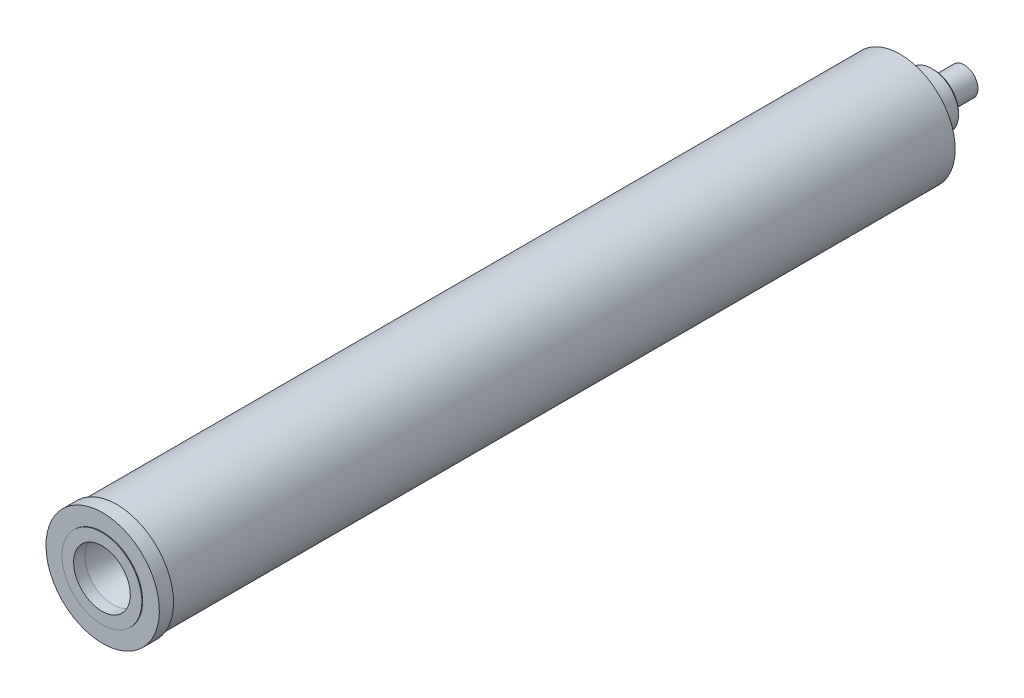
ISO-10303-21;
HEADER;
FILE_DESCRIPTION(('STEP AP214'),'2;1');
FILE_NAME('part.step','',(''),(''),'','','');
FILE_SCHEMA(('AUTOMOTIVE_DESIGN { 1 0 10303 214 1 1 1 1 }'));
ENDSEC;
DATA;
#1=APPLICATION_CONTEXT('core data for automotive mechanical design processes');
#2=APPLICATION_PROTOCOL_DEFINITION('international standard','automotive_design',2000,#1);
#3=PRODUCT_CONTEXT('',#1,'mechanical');
#4=PRODUCT('Part','Part','',(#3));
#5=PRODUCT_RELATED_PRODUCT_CATEGORY('part','',(#4));
#6=PRODUCT_DEFINITION_FORMATION('','',#4);
#7=PRODUCT_DEFINITION_CONTEXT('part definition',#1,'design');
#8=PRODUCT_DEFINITION('design','',#6,#7);
#9=PRODUCT_DEFINITION_SHAPE('','',#8);
#10=(LENGTH_UNIT() NAMED_UNIT(*) SI_UNIT(.MILLI.,.METRE.));
#11=(NAMED_UNIT(*) PLANE_ANGLE_UNIT() SI_UNIT($,.RADIAN.));
#12=(NAMED_UNIT(*) SI_UNIT($,.STERADIAN.) SOLID_ANGLE_UNIT());
#13=UNCERTAINTY_MEASURE_WITH_UNIT(LENGTH_MEASURE(1.E-05),#10,'distance_accuracy_value','');
#14=(GEOMETRIC_REPRESENTATION_CONTEXT(3) GLOBAL_UNCERTAINTY_ASSIGNED_CONTEXT((#13)) GLOBAL_UNIT_ASSIGNED_CONTEXT((#10,
#11,#12)) REPRESENTATION_CONTEXT('',''));
#15=CARTESIAN_POINT('',(0.,0.,0.));
#16=DIRECTION('',(0.,0.,1.));
#17=DIRECTION('',(1.,0.,0.));
#18=AXIS2_PLACEMENT_3D('',#15,#16,#17);
#19=CARTESIAN_POINT('',(0.,50.7999999999999,420.878));
#20=DIRECTION('',(0.,0.,1.));
#21=DIRECTION('',(0.,-1.,0.));
#22=AXIS2_PLACEMENT_3D('',#19,#20,#21);
#23=PLANE('',#22);
#24=CARTESIAN_POINT('',(0.,0.,420.878));
#25=DIRECTION('',(0.,0.,-1.));
#26=DIRECTION('',(0.,1.,0.));
#27=AXIS2_PLACEMENT_3D('',#24,#25,#26);
#28=CIRCLE('',#27,35.7999999999999);
#29=CARTESIAN_POINT('',(0.,35.7999999999999,420.878));
#30=VERTEX_POINT('',#29);
#31=EDGE_CURVE('E58',#30,#30,#28,.T.);
#32=ORIENTED_EDGE('',*,*,#31,.T.);
#33=EDGE_LOOP('',(#32));
#34=FACE_BOUND('',#33,.T.);
#35=CARTESIAN_POINT('',(0.,0.,420.878));
#36=DIRECTION('',(0.,0.,-1.));
#37=DIRECTION('',(0.,1.,0.));
#38=AXIS2_PLACEMENT_3D('',#35,#36,#37);
#39=CIRCLE('',#38,50.7999999999999);
#40=CARTESIAN_POINT('',(0.,50.7999999999999,420.878));
#41=VERTEX_POINT('',#40);
#42=EDGE_CURVE('E113',#41,#41,#39,.T.);
#43=ORIENTED_EDGE('',*,*,#42,.F.);
#44=EDGE_LOOP('',(#43));
#45=FACE_BOUND('',#44,.T.);
#46=ADVANCED_FACE('F39',(#34,#45),#23,.T.);
#47=CARTESIAN_POINT('',(0.,0.,-473.120013679823));
#48=DIRECTION('',(0.,0.,-1.));
#49=DIRECTION('',(0.,1.,0.));
#50=AXIS2_PLACEMENT_3D('',#47,#48,#49);
#51=CYLINDRICAL_SURFACE('',#50,50.7999999999999);
#52=ORIENTED_EDGE('',*,*,#42,.T.);
#53=EDGE_LOOP('',(#52));
#54=FACE_BOUND('',#53,.T.);
#55=CARTESIAN_POINT('',(0.,0.,408.178));
#56=DIRECTION('',(0.,0.,-1.));
#57=DIRECTION('',(0.,1.,0.));
#58=AXIS2_PLACEMENT_3D('',#55,#56,#57);
#59=CIRCLE('',#58,50.7999999999999);
#60=CARTESIAN_POINT('',(0.,50.7999999999999,408.178));
#61=VERTEX_POINT('',#60);
#62=EDGE_CURVE('E110',#61,#61,#59,.T.);
#63=ORIENTED_EDGE('',*,*,#62,.F.);
#64=EDGE_LOOP('',(#63));
#65=FACE_BOUND('',#64,.T.);
#66=ADVANCED_FACE('F132',(#54,#65),#51,.T.);
#67=CARTESIAN_POINT('',(0.,50.7999999999999,408.178));
#68=DIRECTION('',(0.,0.,-1.));
#69=DIRECTION('',(0.,1.,0.));
#70=AXIS2_PLACEMENT_3D('',#67,#68,#69);
#71=PLANE('',#70);
#72=ORIENTED_EDGE('',*,*,#62,.T.);
#73=EDGE_LOOP('',(#72));
#74=FACE_BOUND('',#73,.T.);
#75=CARTESIAN_POINT('',(0.,0.,408.178));
#76=DIRECTION('',(0.,0.,-1.));
#77=DIRECTION('',(0.,1.,0.));
#78=AXIS2_PLACEMENT_3D('',#75,#76,#77);
#79=CIRCLE('',#78,49.2124999999999);
#80=CARTESIAN_POINT('',(0.,49.2124999999999,408.178));
#81=VERTEX_POINT('',#80);
#82=EDGE_CURVE('E107',#81,#81,#79,.T.);
#83=ORIENTED_EDGE('',*,*,#82,.F.);
#84=EDGE_LOOP('',(#83));
#85=FACE_BOUND('',#84,.T.);
#86=ADVANCED_FACE('F137',(#74,#85),#71,.T.);
#87=CARTESIAN_POINT('',(0.,0.,-473.120013679823));
#88=DIRECTION('',(0.,0.,-1.));
#89=DIRECTION('',(0.,1.,0.));
#90=AXIS2_PLACEMENT_3D('',#87,#88,#89);
#91=CYLINDRICAL_SURFACE('',#90,49.2124999999999);
#92=ORIENTED_EDGE('',*,*,#82,.T.);
#93=EDGE_LOOP('',(#92));
#94=FACE_BOUND('',#93,.T.);
#95=CARTESIAN_POINT('',(0.,0.,-293.878));
#96=DIRECTION('',(0.,0.,-1.));
#97=DIRECTION('',(0.,1.,0.));
#98=AXIS2_PLACEMENT_3D('',#95,#96,#97);
#99=CIRCLE('',#98,49.2124999999999);
#100=CARTESIAN_POINT('',(0.,49.2124999999999,-293.878));
#101=VERTEX_POINT('',#100);
#102=EDGE_CURVE('E104',#101,#101,#99,.T.);
#103=ORIENTED_EDGE('',*,*,#102,.F.);
#104=EDGE_LOOP('',(#103));
#105=FACE_BOUND('',#104,.T.);
#106=ADVANCED_FACE('F144',(#94,#105),#91,.T.);
#107=CARTESIAN_POINT('',(0.,49.2124999999999,-293.878));
#108=DIRECTION('',(0.,0.,-1.));
#109=DIRECTION('',(0.,1.,0.));
#110=AXIS2_PLACEMENT_3D('',#107,#108,#109);
#111=PLANE('',#110);
#112=ORIENTED_EDGE('',*,*,#102,.T.);
#113=EDGE_LOOP('',(#112));
#114=FACE_BOUND('',#113,.T.);
#115=CARTESIAN_POINT('',(0.,0.,-293.878));
#116=DIRECTION('',(0.,0.,-1.));
#117=DIRECTION('',(0.,1.,0.));
#118=AXIS2_PLACEMENT_3D('',#115,#116,#117);
#119=CIRCLE('',#118,23.8759999999999);
#120=CARTESIAN_POINT('',(0.,23.876,-293.878));
#121=VERTEX_POINT('',#120);
#122=EDGE_CURVE('E101',#121,#121,#119,.T.);
#123=ORIENTED_EDGE('',*,*,#122,.F.);
#124=EDGE_LOOP('',(#123));
#125=FACE_BOUND('',#124,.T.);
#126=ADVANCED_FACE('F148',(#114,#125),#111,.T.);
#127=CARTESIAN_POINT('',(0.,0.,-473.120013679823));
#128=DIRECTION('',(0.,0.,-1.));
#129=DIRECTION('',(0.,1.,0.));
#130=AXIS2_PLACEMENT_3D('',#127,#128,#129);
#131=CYLINDRICAL_SURFACE('',#130,23.8759999999999);
#132=CARTESIAN_POINT('',(0.,0.,-322.223));
#133=DIRECTION('',(0.,0.,-1.));
#134=DIRECTION('',(0.,1.,0.));
#135=AXIS2_PLACEMENT_3D('',#132,#133,#134);
#136=CIRCLE('',#135,23.8759999999999);
#137=CARTESIAN_POINT('',(0.,23.876,-322.223));
#138=VERTEX_POINT('',#137);
#139=EDGE_CURVE('E11',#138,#138,#136,.F.);
#140=ORIENTED_EDGE('',*,*,#139,.T.);
#141=EDGE_LOOP('',(#140));
#142=FACE_BOUND('',#141,.T.);
#143=ORIENTED_EDGE('',*,*,#122,.T.);
#144=EDGE_LOOP('',(#143));
#145=FACE_BOUND('',#144,.T.);
#146=ADVANCED_FACE('F152',(#142,#145),#131,.T.);
#147=CARTESIAN_POINT('',(0.,23.876,-323.723));
#148=DIRECTION('',(0.,0.,-1.));
#149=DIRECTION('',(0.,1.,0.));
#150=AXIS2_PLACEMENT_3D('',#147,#148,#149);
#151=PLANE('',#150);
#152=CARTESIAN_POINT('',(0.,0.,-323.723));
#153=DIRECTION('',(0.,0.,-1.));
#154=DIRECTION('',(0.,1.,0.));
#155=AXIS2_PLACEMENT_3D('',#152,#153,#154);
#156=CIRCLE('',#155,22.3759999999998);
#157=CARTESIAN_POINT('',(0.,22.3759999999999,-323.723));
#158=VERTEX_POINT('',#157);
#159=EDGE_CURVE('E46',#158,#158,#156,.T.);
#160=ORIENTED_EDGE('',*,*,#159,.T.);
#161=EDGE_LOOP('',(#160));
#162=FACE_BOUND('',#161,.T.);
#163=CARTESIAN_POINT('',(0.,0.,-323.723));
#164=DIRECTION('',(0.,0.,-1.));
#165=DIRECTION('',(0.,1.,0.));
#166=AXIS2_PLACEMENT_3D('',#163,#164,#165);
#167=CIRCLE('',#166,12.4999999999999);
#168=CARTESIAN_POINT('',(0.,12.5,-323.723));
#169=VERTEX_POINT('',#168);
#170=EDGE_CURVE('E98',#169,#169,#167,.T.);
#171=ORIENTED_EDGE('',*,*,#170,.F.);
#172=EDGE_LOOP('',(#171));
#173=FACE_BOUND('',#172,.T.);
#174=ADVANCED_FACE('F118',(#162,#173),#151,.T.);
#175=CARTESIAN_POINT('',(0.,0.,-473.120013679823));
#176=DIRECTION('',(0.,0.,-1.));
#177=DIRECTION('',(0.,1.,0.));
#178=AXIS2_PLACEMENT_3D('',#175,#176,#177);
#179=CYLINDRICAL_SURFACE('',#178,12.4999999999999);
#180=ORIENTED_EDGE('',*,*,#170,.T.);
#181=EDGE_LOOP('',(#180));
#182=FACE_BOUND('',#181,.T.);
#183=CARTESIAN_POINT('',(0.,0.,-351.028));
#184=DIRECTION('',(0.,0.,-1.));
#185=DIRECTION('',(0.,1.,0.));
#186=AXIS2_PLACEMENT_3D('',#183,#184,#185);
#187=CIRCLE('',#186,12.4999999999999);
#188=CARTESIAN_POINT('',(0.,12.5,-351.028));
#189=VERTEX_POINT('',#188);
#190=EDGE_CURVE('E95',#189,#189,#187,.T.);
#191=ORIENTED_EDGE('',*,*,#190,.F.);
#192=EDGE_LOOP('',(#191));
#193=FACE_BOUND('',#192,.T.);
#194=ADVANCED_FACE('F159',(#182,#193),#179,.T.);
#195=CARTESIAN_POINT('',(0.,12.5,-351.028));
#196=DIRECTION('',(0.,0.,-1.));
#197=DIRECTION('',(0.,1.,0.));
#198=AXIS2_PLACEMENT_3D('',#195,#196,#197);
#199=PLANE('',#198);
#200=CARTESIAN_POINT('',(0.,0.,-351.028));
#201=DIRECTION('',(0.,0.,-1.));
#202=DIRECTION('',(0.,1.,0.));
#203=AXIS2_PLACEMENT_3D('',#200,#201,#202);
#204=CIRCLE('',#203,5.3975);
#205=CARTESIAN_POINT('',(0.,5.39750000000005,-351.028));
#206=VERTEX_POINT('',#205);
#207=EDGE_CURVE('E65',#206,#206,#204,.T.);
#208=ORIENTED_EDGE('',*,*,#207,.F.);
#209=EDGE_LOOP('',(#208));
#210=FACE_BOUND('',#209,.T.);
#211=ORIENTED_EDGE('',*,*,#190,.T.);
#212=EDGE_LOOP('',(#211));
#213=FACE_BOUND('',#212,.T.);
#214=ADVANCED_FACE('F162',(#210,#213),#199,.T.);
#215=CARTESIAN_POINT('',(0.,0.,-271.028));
#216=DIRECTION('',(0.,0.,1.));
#217=DIRECTION('',(0.,-1.,0.));
#218=AXIS2_PLACEMENT_3D('',#215,#216,#217);
#219=PLANE('',#218);
#220=CARTESIAN_POINT('',(0.,0.,-271.028));
#221=DIRECTION('',(0.,0.,-1.));
#222=DIRECTION('',(0.,1.,0.));
#223=AXIS2_PLACEMENT_3D('',#220,#221,#222);
#224=CIRCLE('',#223,29.2499999999999);
#225=CARTESIAN_POINT('',(0.,29.25,-271.028));
#226=VERTEX_POINT('',#225);
#227=EDGE_CURVE('E92',#226,#226,#224,.T.);
#228=ORIENTED_EDGE('',*,*,#227,.F.);
#229=EDGE_LOOP('',(#228));
#230=FACE_BOUND('',#229,.T.);
#231=ADVANCED_FACE('F166',(#230),#219,.T.);
#232=CARTESIAN_POINT('',(0.,0.,-473.120013679823));
#233=DIRECTION('',(0.,0.,-1.));
#234=DIRECTION('',(0.,1.,0.));
#235=AXIS2_PLACEMENT_3D('',#232,#233,#234);
#236=CYLINDRICAL_SURFACE('',#235,29.2499999999999);
#237=ORIENTED_EDGE('',*,*,#227,.T.);
#238=EDGE_LOOP('',(#237));
#239=FACE_BOUND('',#238,.T.);
#240=CARTESIAN_POINT('',(0.,0.,301.513));
#241=DIRECTION('',(0.,0.,-1.));
#242=DIRECTION('',(0.,1.,0.));
#243=AXIS2_PLACEMENT_3D('',#240,#241,#242);
#244=CIRCLE('',#243,29.2499999999999);
#245=CARTESIAN_POINT('',(0.,29.2499999999999,301.513));
#246=VERTEX_POINT('',#245);
#247=EDGE_CURVE('E89',#246,#246,#244,.T.);
#248=ORIENTED_EDGE('',*,*,#247,.F.);
#249=EDGE_LOOP('',(#248));
#250=FACE_BOUND('',#249,.T.);
#251=ADVANCED_FACE('F170',(#239,#250),#236,.F.);
#252=CARTESIAN_POINT('',(0.,29.2499999999999,301.513));
#253=DIRECTION('',(0.,0.,1.));
#254=DIRECTION('',(0.,-1.,0.));
#255=AXIS2_PLACEMENT_3D('',#252,#253,#254);
#256=PLANE('',#255);
#257=ORIENTED_EDGE('',*,*,#247,.T.);
#258=EDGE_LOOP('',(#257));
#259=FACE_BOUND('',#258,.T.);
#260=CARTESIAN_POINT('',(0.,0.,301.513));
#261=DIRECTION('',(0.,0.,-1.));
#262=DIRECTION('',(0.,1.,0.));
#263=AXIS2_PLACEMENT_3D('',#260,#261,#262);
#264=CIRCLE('',#263,40.2499999999999);
#265=CARTESIAN_POINT('',(0.,40.2499999999999,301.513));
#266=VERTEX_POINT('',#265);
#267=EDGE_CURVE('E86',#266,#266,#264,.T.);
#268=ORIENTED_EDGE('',*,*,#267,.F.);
#269=EDGE_LOOP('',(#268));
#270=FACE_BOUND('',#269,.T.);
#271=ADVANCED_FACE('F174',(#259,#270),#256,.T.);
#272=CARTESIAN_POINT('',(0.,0.,-473.120013679823));
#273=DIRECTION('',(0.,0.,-1.));
#274=DIRECTION('',(0.,1.,0.));
#275=AXIS2_PLACEMENT_3D('',#272,#273,#274);
#276=CYLINDRICAL_SURFACE('',#275,40.2499999999999);
#277=ORIENTED_EDGE('',*,*,#267,.T.);
#278=EDGE_LOOP('',(#277));
#279=FACE_BOUND('',#278,.T.);
#280=CARTESIAN_POINT('',(0.,0.,309.506817628507));
#281=DIRECTION('',(0.,0.,-1.));
#282=DIRECTION('',(0.,1.,0.));
#283=AXIS2_PLACEMENT_3D('',#280,#281,#282);
#284=CIRCLE('',#283,40.2499999999999);
#285=CARTESIAN_POINT('',(0.,40.2499999999999,309.506817628507));
#286=VERTEX_POINT('',#285);
#287=EDGE_CURVE('E83',#286,#286,#284,.T.);
#288=ORIENTED_EDGE('',*,*,#287,.F.);
#289=EDGE_LOOP('',(#288));
#290=FACE_BOUND('',#289,.T.);
#291=ADVANCED_FACE('F178',(#279,#290),#276,.F.);
#292=CARTESIAN_POINT('',(0.,0.,336.513));
#293=DIRECTION('',(0.,0.,-1.));
#294=DIRECTION('',(0.,1.,0.));
#295=AXIS2_PLACEMENT_3D('',#292,#293,#294);
#296=CONICAL_SURFACE('',#295,13.2438176285069,0.785398163397448);
#297=ORIENTED_EDGE('',*,*,#287,.T.);
#298=EDGE_LOOP('',(#297));
#299=FACE_BOUND('',#298,.T.);
#300=CARTESIAN_POINT('',(0.,0.,336.513));
#301=DIRECTION('',(0.,0.,-1.));
#302=DIRECTION('',(0.,1.,0.));
#303=AXIS2_PLACEMENT_3D('',#300,#301,#302);
#304=CIRCLE('',#303,13.2438176285069);
#305=CARTESIAN_POINT('',(0.,13.2438176285069,336.513));
#306=VERTEX_POINT('',#305);
#307=EDGE_CURVE('E80',#306,#306,#304,.T.);
#308=ORIENTED_EDGE('',*,*,#307,.F.);
#309=EDGE_LOOP('',(#308));
#310=FACE_BOUND('',#309,.T.);
#311=ADVANCED_FACE('F182',(#299,#310),#296,.F.);
#312=CARTESIAN_POINT('',(0.,0.,351.513));
#313=DIRECTION('',(0.,0.,1.));
#314=DIRECTION('',(0.,-1.,0.));
#315=AXIS2_PLACEMENT_3D('',#312,#313,#314);
#316=CONICAL_SURFACE('',#315,14.820381157492,0.104719755119653);
#317=ORIENTED_EDGE('',*,*,#307,.T.);
#318=EDGE_LOOP('',(#317));
#319=FACE_BOUND('',#318,.T.);
#320=CARTESIAN_POINT('',(0.,0.,351.513));
#321=DIRECTION('',(0.,0.,-1.));
#322=DIRECTION('',(0.,1.,0.));
#323=AXIS2_PLACEMENT_3D('',#320,#321,#322);
#324=CIRCLE('',#323,14.820381157492);
#325=CARTESIAN_POINT('',(0.,14.820381157492,351.513));
#326=VERTEX_POINT('',#325);
#327=EDGE_CURVE('E77',#326,#326,#324,.T.);
#328=ORIENTED_EDGE('',*,*,#327,.F.);
#329=EDGE_LOOP('',(#328));
#330=FACE_BOUND('',#329,.T.);
#331=ADVANCED_FACE('F186',(#319,#330),#316,.F.);
#332=CARTESIAN_POINT('',(0.,0.,411.513));
#333=DIRECTION('',(0.,0.,1.));
#334=DIRECTION('',(0.,-1.,0.));
#335=AXIS2_PLACEMENT_3D('',#332,#333,#334);
#336=CONICAL_SURFACE('',#335,25.3999999999999,0.174532925199433);
#337=ORIENTED_EDGE('',*,*,#327,.T.);
#338=EDGE_LOOP('',(#337));
#339=FACE_BOUND('',#338,.T.);
#340=CARTESIAN_POINT('',(0.,0.,411.513));
#341=DIRECTION('',(0.,0.,-1.));
#342=DIRECTION('',(0.,1.,0.));
#343=AXIS2_PLACEMENT_3D('',#340,#341,#342);
#344=CIRCLE('',#343,25.3999999999999);
#345=CARTESIAN_POINT('',(0.,25.3999999999999,411.513));
#346=VERTEX_POINT('',#345);
#347=EDGE_CURVE('E74',#346,#346,#344,.T.);
#348=ORIENTED_EDGE('',*,*,#347,.F.);
#349=EDGE_LOOP('',(#348));
#350=FACE_BOUND('',#349,.T.);
#351=ADVANCED_FACE('F190',(#339,#350),#336,.F.);
#352=CARTESIAN_POINT('',(0.,0.,-473.120013679823));
#353=DIRECTION('',(0.,0.,-1.));
#354=DIRECTION('',(0.,1.,0.));
#355=AXIS2_PLACEMENT_3D('',#352,#353,#354);
#356=CYLINDRICAL_SURFACE('',#355,25.3999999999999);
#357=ORIENTED_EDGE('',*,*,#347,.T.);
#358=EDGE_LOOP('',(#357));
#359=FACE_BOUND('',#358,.T.);
#360=CARTESIAN_POINT('',(0.,0.,421.513));
#361=DIRECTION('',(0.,0.,-1.));
#362=DIRECTION('',(0.,1.,0.));
#363=AXIS2_PLACEMENT_3D('',#360,#361,#362);
#364=CIRCLE('',#363,25.3999999999999);
#365=CARTESIAN_POINT('',(0.,25.3999999999999,421.513));
#366=VERTEX_POINT('',#365);
#367=EDGE_CURVE('E71',#366,#366,#364,.T.);
#368=ORIENTED_EDGE('',*,*,#367,.F.);
#369=EDGE_LOOP('',(#368));
#370=FACE_BOUND('',#369,.T.);
#371=ADVANCED_FACE('F194',(#359,#370),#356,.F.);
#372=CARTESIAN_POINT('',(0.,35.7999999999999,421.513));
#373=DIRECTION('',(0.,0.,1.));
#374=DIRECTION('',(0.,-1.,0.));
#375=AXIS2_PLACEMENT_3D('',#372,#373,#374);
#376=PLANE('',#375);
#377=ORIENTED_EDGE('',*,*,#367,.T.);
#378=EDGE_LOOP('',(#377));
#379=FACE_BOUND('',#378,.T.);
#380=CARTESIAN_POINT('',(0.,0.,421.513));
#381=DIRECTION('',(0.,0.,-1.));
#382=DIRECTION('',(0.,1.,0.));
#383=AXIS2_PLACEMENT_3D('',#380,#381,#382);
#384=CIRCLE('',#383,35.7999999999999);
#385=CARTESIAN_POINT('',(0.,35.7999999999999,421.513));
#386=VERTEX_POINT('',#385);
#387=EDGE_CURVE('E62',#386,#386,#384,.T.);
#388=ORIENTED_EDGE('',*,*,#387,.F.);
#389=EDGE_LOOP('',(#388));
#390=FACE_BOUND('',#389,.T.);
#391=ADVANCED_FACE('F127',(#379,#390),#376,.T.);
#392=CARTESIAN_POINT('',(0.,0.,-473.120013679823));
#393=DIRECTION('',(0.,0.,-1.));
#394=DIRECTION('',(0.,1.,0.));
#395=AXIS2_PLACEMENT_3D('',#392,#393,#394);
#396=CYLINDRICAL_SURFACE('',#395,35.7999999999999);
#397=ORIENTED_EDGE('',*,*,#387,.T.);
#398=EDGE_LOOP('',(#397));
#399=FACE_BOUND('',#398,.T.);
#400=ORIENTED_EDGE('',*,*,#31,.F.);
#401=EDGE_LOOP('',(#400));
#402=FACE_BOUND('',#401,.T.);
#403=ADVANCED_FACE('F122',(#399,#402),#396,.T.);
#404=CARTESIAN_POINT('',(0.,0.,-323.723));
#405=DIRECTION('',(0.,0.,1.));
#406=DIRECTION('',(0.,-1.,0.));
#407=AXIS2_PLACEMENT_3D('',#404,#405,#406);
#408=CONICAL_SURFACE('',#407,22.3759999999998,0.785398163397439);
#409=ORIENTED_EDGE('',*,*,#139,.F.);
#410=EDGE_LOOP('',(#409));
#411=FACE_BOUND('',#410,.T.);
#412=ORIENTED_EDGE('',*,*,#159,.F.);
#413=EDGE_LOOP('',(#412));
#414=FACE_BOUND('',#413,.T.);
#415=ADVANCED_FACE('F41',(#411,#414),#408,.T.);
#416=CARTESIAN_POINT('',(0.,0.,-325.628));
#417=DIRECTION('',(0.,0.,-1.));
#418=DIRECTION('',(0.,1.,0.));
#419=AXIS2_PLACEMENT_3D('',#416,#417,#418);
#420=CONICAL_SURFACE('',#419,3.96874999999999,1.02974425867665);
#421=CARTESIAN_POINT('',(0.,0.,-323.243334418234));
#422=VERTEX_POINT('',#421);
#423=VERTEX_LOOP('',#422);
#424=FACE_BOUND('',#423,.T.);
#425=CARTESIAN_POINT('',(0.,0.,-325.628));
#426=DIRECTION('',(0.,0.,-1.));
#427=DIRECTION('',(0.,1.,0.));
#428=AXIS2_PLACEMENT_3D('',#425,#426,#427);
#429=CIRCLE('',#428,3.96874999999999);
#430=CARTESIAN_POINT('',(0.,3.96875000000005,-325.628));
#431=VERTEX_POINT('',#430);
#432=EDGE_CURVE('E56',#431,#431,#429,.T.);
#433=ORIENTED_EDGE('',*,*,#432,.T.);
#434=EDGE_LOOP('',(#433));
#435=FACE_BOUND('',#434,.T.);
#436=ADVANCED_FACE('F49',(#424,#435),#420,.F.);
#437=CARTESIAN_POINT('',(0.,0.,-351.028));
#438=DIRECTION('',(0.,0.,-1.));
#439=DIRECTION('',(0.,1.,0.));
#440=AXIS2_PLACEMENT_3D('',#437,#438,#439);
#441=CYLINDRICAL_SURFACE('',#440,3.96875);
#442=ORIENTED_EDGE('',*,*,#432,.F.);
#443=EDGE_LOOP('',(#442));
#444=FACE_BOUND('',#443,.T.);
#445=CARTESIAN_POINT('',(0.,0.,-349.829136401955));
#446=DIRECTION('',(0.,0.,-1.));
#447=DIRECTION('',(0.,1.,0.));
#448=AXIS2_PLACEMENT_3D('',#445,#446,#447);
#449=CIRCLE('',#448,3.96875);
#450=CARTESIAN_POINT('',(0.,3.96875000000005,-349.829136401955));
#451=VERTEX_POINT('',#450);
#452=EDGE_CURVE('E59',#451,#451,#449,.T.);
#453=ORIENTED_EDGE('',*,*,#452,.T.);
#454=EDGE_LOOP('',(#453));
#455=FACE_BOUND('',#454,.T.);
#456=ADVANCED_FACE('F52',(#444,#455),#441,.F.);
#457=CARTESIAN_POINT('',(0.,0.,-351.028));
#458=DIRECTION('',(0.,0.,-1.));
#459=DIRECTION('',(0.,1.,0.));
#460=AXIS2_PLACEMENT_3D('',#457,#458,#459);
#461=CONICAL_SURFACE('',#460,5.3975,0.87266462599716);
#462=ORIENTED_EDGE('',*,*,#452,.F.);
#463=EDGE_LOOP('',(#462));
#464=FACE_BOUND('',#463,.T.);
#465=ORIENTED_EDGE('',*,*,#207,.T.);
#466=EDGE_LOOP('',(#465));
#467=FACE_BOUND('',#466,.T.);
#468=ADVANCED_FACE('F204',(#464,#467),#461,.F.);
#469=CLOSED_SHELL('',(#46,#66,#86,#106,#126,#146,#174,#194,#214,#231,#251,#271,#291,#311,#331,
#351,#371,#391,#403,#415,#436,#456,#468));
#470=MANIFOLD_SOLID_BREP('B2',#469);
#471=ADVANCED_BREP_SHAPE_REPRESENTATION('',(#18,#470),#14);
#472=SHAPE_DEFINITION_REPRESENTATION(#9,#471);
ENDSEC;
END-ISO-10303-21;
